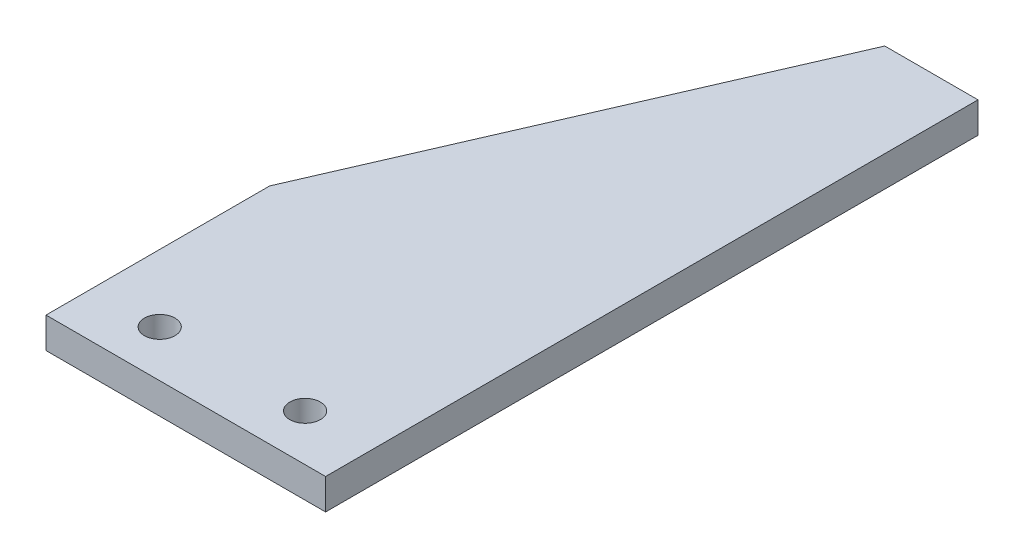
ISO-10303-21;
HEADER;
FILE_DESCRIPTION(('STEP AP214'),'2;1');
FILE_NAME('part.step','',(''),(''),'','','');
FILE_SCHEMA(('AUTOMOTIVE_DESIGN { 1 0 10303 214 1 1 1 1 }'));
ENDSEC;
DATA;
#1=APPLICATION_CONTEXT('core data for automotive mechanical design processes');
#2=APPLICATION_PROTOCOL_DEFINITION('international standard','automotive_design',2000,#1);
#3=PRODUCT_CONTEXT('',#1,'mechanical');
#4=PRODUCT('Part','Part','',(#3));
#5=PRODUCT_RELATED_PRODUCT_CATEGORY('part','',(#4));
#6=PRODUCT_DEFINITION_FORMATION('','',#4);
#7=PRODUCT_DEFINITION_CONTEXT('part definition',#1,'design');
#8=PRODUCT_DEFINITION('design','',#6,#7);
#9=PRODUCT_DEFINITION_SHAPE('','',#8);
#10=(LENGTH_UNIT() NAMED_UNIT(*) SI_UNIT(.MILLI.,.METRE.));
#11=(NAMED_UNIT(*) PLANE_ANGLE_UNIT() SI_UNIT($,.RADIAN.));
#12=(NAMED_UNIT(*) SI_UNIT($,.STERADIAN.) SOLID_ANGLE_UNIT());
#13=UNCERTAINTY_MEASURE_WITH_UNIT(LENGTH_MEASURE(1.E-05),#10,'distance_accuracy_value','');
#14=(GEOMETRIC_REPRESENTATION_CONTEXT(3) GLOBAL_UNCERTAINTY_ASSIGNED_CONTEXT((#13)) GLOBAL_UNIT_ASSIGNED_CONTEXT((#10,
#11,#12)) REPRESENTATION_CONTEXT('',''));
#15=CARTESIAN_POINT('',(0.,0.,0.));
#16=DIRECTION('',(0.,0.,1.));
#17=DIRECTION('',(1.,0.,0.));
#18=AXIS2_PLACEMENT_3D('',#15,#16,#17);
#19=CARTESIAN_POINT('',(0.,4.191,0.));
#20=DIRECTION('',(0.,-1.,0.));
#21=DIRECTION('',(0.,0.,-1.));
#22=AXIS2_PLACEMENT_3D('',#19,#20,#21);
#23=PLANE('',#22);
#24=DIRECTION('',(1.,0.,0.));
#25=VECTOR('',#24,1.);
#26=CARTESIAN_POINT('',(38.1,4.191,0.));
#27=LINE('',#26,#25);
#28=CARTESIAN_POINT('',(0.,4.191,0.));
#29=VERTEX_POINT('',#28);
#30=CARTESIAN_POINT('',(38.1,4.191,0.));
#31=VERTEX_POINT('',#30);
#32=EDGE_CURVE('E117',#29,#31,#27,.T.);
#33=ORIENTED_EDGE('',*,*,#32,.T.);
#34=DIRECTION('',(0.,0.,-1.));
#35=VECTOR('',#34,1.);
#36=CARTESIAN_POINT('',(38.1,4.191,-88.9));
#37=LINE('',#36,#35);
#38=CARTESIAN_POINT('',(38.1,4.191,-88.9));
#39=VERTEX_POINT('',#38);
#40=EDGE_CURVE('E84',#31,#39,#37,.T.);
#41=ORIENTED_EDGE('',*,*,#40,.T.);
#42=DIRECTION('',(-1.,0.,0.));
#43=VECTOR('',#42,1.);
#44=CARTESIAN_POINT('',(25.4,4.191,-88.9));
#45=LINE('',#44,#43);
#46=CARTESIAN_POINT('',(25.4,4.191,-88.9));
#47=VERTEX_POINT('',#46);
#48=EDGE_CURVE('E88',#39,#47,#45,.T.);
#49=ORIENTED_EDGE('',*,*,#48,.T.);
#50=DIRECTION('',(-0.39872611141445,0.,0.917070056253235));
#51=VECTOR('',#50,1.);
#52=CARTESIAN_POINT('',(0.,4.191,-30.48));
#53=LINE('',#52,#51);
#54=CARTESIAN_POINT('',(0.,4.191,-30.48));
#55=VERTEX_POINT('',#54);
#56=EDGE_CURVE('E92',#47,#55,#53,.T.);
#57=ORIENTED_EDGE('',*,*,#56,.T.);
#58=DIRECTION('',(0.,0.,1.));
#59=VECTOR('',#58,1.);
#60=CARTESIAN_POINT('',(0.,4.191,0.));
#61=LINE('',#60,#59);
#62=EDGE_CURVE('E50',#55,#29,#61,.T.);
#63=ORIENTED_EDGE('',*,*,#62,.T.);
#64=EDGE_LOOP('',(#33,#41,#49,#57,#63));
#65=FACE_BOUND('',#64,.T.);
#66=CARTESIAN_POINT('',(9.144,4.191,-6.35));
#67=DIRECTION('',(0.,1.,0.));
#68=DIRECTION('',(0.,0.,1.));
#69=AXIS2_PLACEMENT_3D('',#66,#67,#68);
#70=CIRCLE('',#69,2.0828);
#71=CARTESIAN_POINT('',(9.144,4.191,-4.2672));
#72=VERTEX_POINT('',#71);
#73=EDGE_CURVE('E112',#72,#72,#70,.T.);
#74=ORIENTED_EDGE('',*,*,#73,.F.);
#75=EDGE_LOOP('',(#74));
#76=FACE_BOUND('',#75,.T.);
#77=CARTESIAN_POINT('',(28.956,4.191,-6.34999999999999));
#78=DIRECTION('',(0.,1.,0.));
#79=DIRECTION('',(0.,0.,1.));
#80=AXIS2_PLACEMENT_3D('',#77,#78,#79);
#81=CIRCLE('',#80,2.0828);
#82=CARTESIAN_POINT('',(28.956,4.191,-4.2672));
#83=VERTEX_POINT('',#82);
#84=EDGE_CURVE('E153',#83,#83,#81,.T.);
#85=ORIENTED_EDGE('',*,*,#84,.F.);
#86=EDGE_LOOP('',(#85));
#87=FACE_BOUND('',#86,.T.);
#88=ADVANCED_FACE('F33',(#65,#76,#87),#23,.F.);
#89=CARTESIAN_POINT('',(0.,0.,0.));
#90=DIRECTION('',(0.,-1.,0.));
#91=DIRECTION('',(0.,0.,-1.));
#92=AXIS2_PLACEMENT_3D('',#89,#90,#91);
#93=PLANE('',#92);
#94=CARTESIAN_POINT('',(9.144,0.,-6.35));
#95=DIRECTION('',(0.,1.,0.));
#96=DIRECTION('',(0.,0.,1.));
#97=AXIS2_PLACEMENT_3D('',#94,#95,#96);
#98=CIRCLE('',#97,2.0828);
#99=CARTESIAN_POINT('',(9.144,0.,-4.2672));
#100=VERTEX_POINT('',#99);
#101=EDGE_CURVE('E158',#100,#100,#98,.T.);
#102=ORIENTED_EDGE('',*,*,#101,.T.);
#103=EDGE_LOOP('',(#102));
#104=FACE_BOUND('',#103,.T.);
#105=DIRECTION('',(1.,0.,0.));
#106=VECTOR('',#105,1.);
#107=CARTESIAN_POINT('',(38.1,0.,0.));
#108=LINE('',#107,#106);
#109=CARTESIAN_POINT('',(0.,0.,0.));
#110=VERTEX_POINT('',#109);
#111=CARTESIAN_POINT('',(38.1,0.,0.));
#112=VERTEX_POINT('',#111);
#113=EDGE_CURVE('E108',#110,#112,#108,.T.);
#114=ORIENTED_EDGE('',*,*,#113,.F.);
#115=DIRECTION('',(0.,0.,1.));
#116=VECTOR('',#115,1.);
#117=CARTESIAN_POINT('',(0.,0.,0.));
#118=LINE('',#117,#116);
#119=CARTESIAN_POINT('',(0.,0.,-30.48));
#120=VERTEX_POINT('',#119);
#121=EDGE_CURVE('E76',#120,#110,#118,.T.);
#122=ORIENTED_EDGE('',*,*,#121,.F.);
#123=DIRECTION('',(-0.39872611141445,0.,0.917070056253235));
#124=VECTOR('',#123,1.);
#125=CARTESIAN_POINT('',(0.,0.,-30.48));
#126=LINE('',#125,#124);
#127=CARTESIAN_POINT('',(25.4,0.,-88.9));
#128=VERTEX_POINT('',#127);
#129=EDGE_CURVE('E70',#128,#120,#126,.T.);
#130=ORIENTED_EDGE('',*,*,#129,.F.);
#131=DIRECTION('',(-1.,0.,0.));
#132=VECTOR('',#131,1.);
#133=CARTESIAN_POINT('',(25.4,0.,-88.9));
#134=LINE('',#133,#132);
#135=CARTESIAN_POINT('',(38.1,0.,-88.9));
#136=VERTEX_POINT('',#135);
#137=EDGE_CURVE('E99',#136,#128,#134,.T.);
#138=ORIENTED_EDGE('',*,*,#137,.F.);
#139=DIRECTION('',(0.,0.,-1.));
#140=VECTOR('',#139,1.);
#141=CARTESIAN_POINT('',(38.1,0.,-88.9));
#142=LINE('',#141,#140);
#143=EDGE_CURVE('E111',#112,#136,#142,.T.);
#144=ORIENTED_EDGE('',*,*,#143,.F.);
#145=EDGE_LOOP('',(#114,#122,#130,#138,#144));
#146=FACE_BOUND('',#145,.T.);
#147=CARTESIAN_POINT('',(28.956,0.,-6.34999999999999));
#148=DIRECTION('',(0.,1.,0.));
#149=DIRECTION('',(0.,0.,1.));
#150=AXIS2_PLACEMENT_3D('',#147,#148,#149);
#151=CIRCLE('',#150,2.0828);
#152=CARTESIAN_POINT('',(28.956,0.,-4.2672));
#153=VERTEX_POINT('',#152);
#154=EDGE_CURVE('E156',#153,#153,#151,.T.);
#155=ORIENTED_EDGE('',*,*,#154,.T.);
#156=EDGE_LOOP('',(#155));
#157=FACE_BOUND('',#156,.T.);
#158=ADVANCED_FACE('F121',(#104,#146,#157),#93,.T.);
#159=CARTESIAN_POINT('',(38.1,4.191,0.));
#160=DIRECTION('',(0.,0.,-1.));
#161=DIRECTION('',(-1.,0.,0.));
#162=AXIS2_PLACEMENT_3D('',#159,#160,#161);
#163=PLANE('',#162);
#164=ORIENTED_EDGE('',*,*,#113,.T.);
#165=DIRECTION('',(0.,-1.,0.));
#166=VECTOR('',#165,1.);
#167=CARTESIAN_POINT('',(38.1,4.191,0.));
#168=LINE('',#167,#166);
#169=EDGE_CURVE('E11',#31,#112,#168,.T.);
#170=ORIENTED_EDGE('',*,*,#169,.F.);
#171=ORIENTED_EDGE('',*,*,#32,.F.);
#172=DIRECTION('',(0.,-1.,0.));
#173=VECTOR('',#172,1.);
#174=CARTESIAN_POINT('',(0.,4.191,0.));
#175=LINE('',#174,#173);
#176=EDGE_CURVE('E104',#29,#110,#175,.T.);
#177=ORIENTED_EDGE('',*,*,#176,.T.);
#178=EDGE_LOOP('',(#164,#170,#171,#177));
#179=FACE_BOUND('',#178,.T.);
#180=ADVANCED_FACE('F35',(#179),#163,.F.);
#181=CARTESIAN_POINT('',(38.1,4.191,-88.9));
#182=DIRECTION('',(-1.,0.,0.));
#183=DIRECTION('',(0.,0.,1.));
#184=AXIS2_PLACEMENT_3D('',#181,#182,#183);
#185=PLANE('',#184);
#186=ORIENTED_EDGE('',*,*,#143,.T.);
#187=DIRECTION('',(0.,-1.,0.));
#188=VECTOR('',#187,1.);
#189=CARTESIAN_POINT('',(38.1,4.191,-88.9));
#190=LINE('',#189,#188);
#191=EDGE_CURVE('E42',#39,#136,#190,.T.);
#192=ORIENTED_EDGE('',*,*,#191,.F.);
#193=ORIENTED_EDGE('',*,*,#40,.F.);
#194=ORIENTED_EDGE('',*,*,#169,.T.);
#195=EDGE_LOOP('',(#186,#192,#193,#194));
#196=FACE_BOUND('',#195,.T.);
#197=ADVANCED_FACE('F192',(#196),#185,.F.);
#198=CARTESIAN_POINT('',(25.4,4.191,-88.9));
#199=DIRECTION('',(0.,0.,1.));
#200=DIRECTION('',(1.,0.,0.));
#201=AXIS2_PLACEMENT_3D('',#198,#199,#200);
#202=PLANE('',#201);
#203=ORIENTED_EDGE('',*,*,#137,.T.);
#204=DIRECTION('',(0.,-1.,0.));
#205=VECTOR('',#204,1.);
#206=CARTESIAN_POINT('',(25.4,4.191,-88.9));
#207=LINE('',#206,#205);
#208=EDGE_CURVE('E96',#47,#128,#207,.T.);
#209=ORIENTED_EDGE('',*,*,#208,.F.);
#210=ORIENTED_EDGE('',*,*,#48,.F.);
#211=ORIENTED_EDGE('',*,*,#191,.T.);
#212=EDGE_LOOP('',(#203,#209,#210,#211));
#213=FACE_BOUND('',#212,.T.);
#214=ADVANCED_FACE('F97',(#213),#202,.F.);
#215=CARTESIAN_POINT('',(0.,4.191,-30.48));
#216=DIRECTION('',(0.917070056253235,0.,0.39872611141445));
#217=DIRECTION('',(0.39872611141445,0.,-0.917070056253235));
#218=AXIS2_PLACEMENT_3D('',#215,#216,#217);
#219=PLANE('',#218);
#220=ORIENTED_EDGE('',*,*,#129,.T.);
#221=DIRECTION('',(0.,-1.,0.));
#222=VECTOR('',#221,1.);
#223=CARTESIAN_POINT('',(0.,4.191,-30.48));
#224=LINE('',#223,#222);
#225=EDGE_CURVE('E100',#55,#120,#224,.T.);
#226=ORIENTED_EDGE('',*,*,#225,.F.);
#227=ORIENTED_EDGE('',*,*,#56,.F.);
#228=ORIENTED_EDGE('',*,*,#208,.T.);
#229=EDGE_LOOP('',(#220,#226,#227,#228));
#230=FACE_BOUND('',#229,.T.);
#231=ADVANCED_FACE('F102',(#230),#219,.F.);
#232=CARTESIAN_POINT('',(0.,4.191,0.));
#233=DIRECTION('',(1.,0.,0.));
#234=DIRECTION('',(0.,0.,-1.));
#235=AXIS2_PLACEMENT_3D('',#232,#233,#234);
#236=PLANE('',#235);
#237=ORIENTED_EDGE('',*,*,#121,.T.);
#238=ORIENTED_EDGE('',*,*,#176,.F.);
#239=ORIENTED_EDGE('',*,*,#62,.F.);
#240=ORIENTED_EDGE('',*,*,#225,.T.);
#241=EDGE_LOOP('',(#237,#238,#239,#240));
#242=FACE_BOUND('',#241,.T.);
#243=ADVANCED_FACE('F126',(#242),#236,.F.);
#244=CARTESIAN_POINT('',(9.144,4.191,-6.35));
#245=DIRECTION('',(0.,-1.,0.));
#246=DIRECTION('',(0.,0.,-1.));
#247=AXIS2_PLACEMENT_3D('',#244,#245,#246);
#248=CYLINDRICAL_SURFACE('',#247,2.0828);
#249=ORIENTED_EDGE('',*,*,#73,.T.);
#250=EDGE_LOOP('',(#249));
#251=FACE_BOUND('',#250,.T.);
#252=ORIENTED_EDGE('',*,*,#101,.F.);
#253=EDGE_LOOP('',(#252));
#254=FACE_BOUND('',#253,.T.);
#255=ADVANCED_FACE('F128',(#251,#254),#248,.F.);
#256=CARTESIAN_POINT('',(28.956,4.191,-6.34999999999999));
#257=DIRECTION('',(0.,-1.,0.));
#258=DIRECTION('',(0.,0.,-1.));
#259=AXIS2_PLACEMENT_3D('',#256,#257,#258);
#260=CYLINDRICAL_SURFACE('',#259,2.0828);
#261=ORIENTED_EDGE('',*,*,#84,.T.);
#262=EDGE_LOOP('',(#261));
#263=FACE_BOUND('',#262,.T.);
#264=ORIENTED_EDGE('',*,*,#154,.F.);
#265=EDGE_LOOP('',(#264));
#266=FACE_BOUND('',#265,.T.);
#267=ADVANCED_FACE('F134',(#263,#266),#260,.F.);
#268=CLOSED_SHELL('',(#88,#158,#180,#197,#214,#231,#243,#255,#267));
#269=MANIFOLD_SOLID_BREP('B2',#268);
#270=ADVANCED_BREP_SHAPE_REPRESENTATION('',(#18,#269),#14);
#271=SHAPE_DEFINITION_REPRESENTATION(#9,#270);
ENDSEC;
END-ISO-10303-21;
